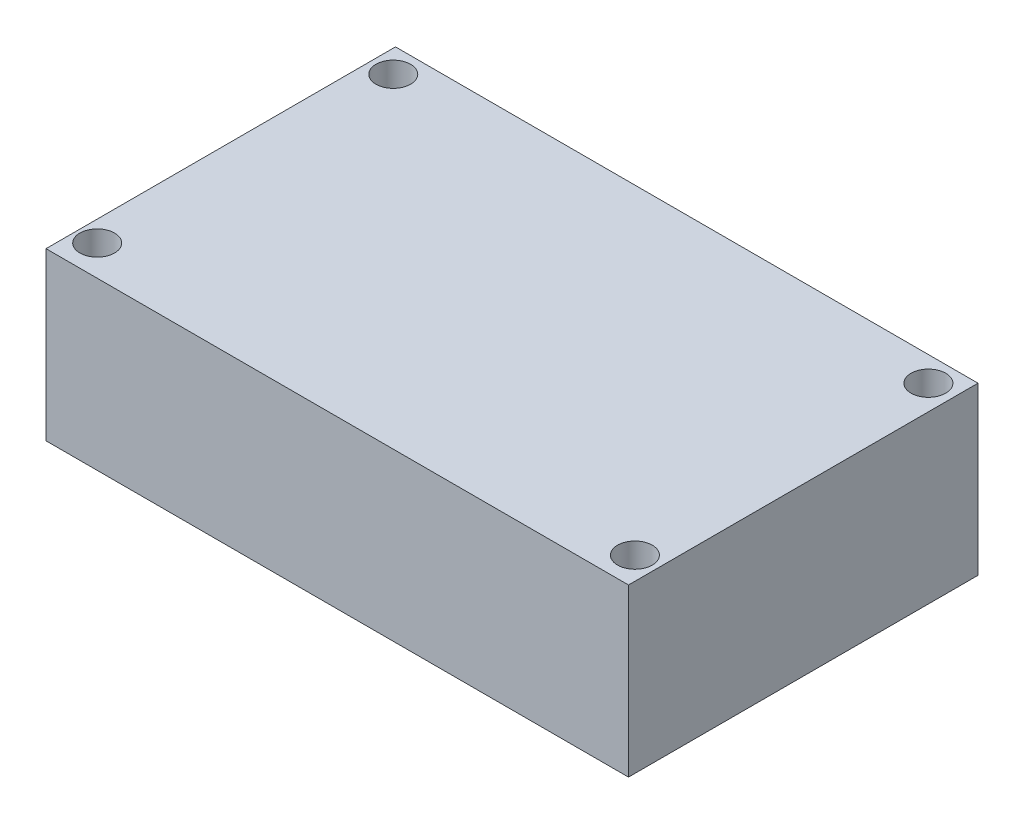
ISO-10303-21;
HEADER;
FILE_DESCRIPTION(('STEP AP214'),'2;1');
FILE_NAME('part.step','',(''),(''),'','','');
FILE_SCHEMA(('AUTOMOTIVE_DESIGN { 1 0 10303 214 1 1 1 1 }'));
ENDSEC;
DATA;
#1=APPLICATION_CONTEXT('core data for automotive mechanical design processes');
#2=APPLICATION_PROTOCOL_DEFINITION('international standard','automotive_design',2000,#1);
#3=PRODUCT_CONTEXT('',#1,'mechanical');
#4=PRODUCT('Part','Part','',(#3));
#5=PRODUCT_RELATED_PRODUCT_CATEGORY('part','',(#4));
#6=PRODUCT_DEFINITION_FORMATION('','',#4);
#7=PRODUCT_DEFINITION_CONTEXT('part definition',#1,'design');
#8=PRODUCT_DEFINITION('design','',#6,#7);
#9=PRODUCT_DEFINITION_SHAPE('','',#8);
#10=(LENGTH_UNIT() NAMED_UNIT(*) SI_UNIT(.MILLI.,.METRE.));
#11=(NAMED_UNIT(*) PLANE_ANGLE_UNIT() SI_UNIT($,.RADIAN.));
#12=(NAMED_UNIT(*) SI_UNIT($,.STERADIAN.) SOLID_ANGLE_UNIT());
#13=UNCERTAINTY_MEASURE_WITH_UNIT(LENGTH_MEASURE(1.E-05),#10,'distance_accuracy_value','');
#14=(GEOMETRIC_REPRESENTATION_CONTEXT(3) GLOBAL_UNCERTAINTY_ASSIGNED_CONTEXT((#13)) GLOBAL_UNIT_ASSIGNED_CONTEXT((#10,
#11,#12)) REPRESENTATION_CONTEXT('',''));
#15=CARTESIAN_POINT('',(0.,0.,0.));
#16=DIRECTION('',(0.,0.,1.));
#17=DIRECTION('',(1.,0.,0.));
#18=AXIS2_PLACEMENT_3D('',#15,#16,#17);
#19=CARTESIAN_POINT('',(21.,12.,12.6));
#20=DIRECTION('',(-1.,0.,0.));
#21=DIRECTION('',(0.,0.,1.));
#22=AXIS2_PLACEMENT_3D('',#19,#20,#21);
#23=PLANE('',#22);
#24=DIRECTION('',(0.,0.,-1.));
#25=VECTOR('',#24,1.);
#26=CARTESIAN_POINT('',(21.,0.,12.6));
#27=LINE('',#26,#25);
#28=CARTESIAN_POINT('',(21.,0.,12.6));
#29=VERTEX_POINT('',#28);
#30=CARTESIAN_POINT('',(21.,0.,-12.6));
#31=VERTEX_POINT('',#30);
#32=EDGE_CURVE('E115',#29,#31,#27,.T.);
#33=ORIENTED_EDGE('',*,*,#32,.T.);
#34=DIRECTION('',(0.,-1.,0.));
#35=VECTOR('',#34,1.);
#36=CARTESIAN_POINT('',(21.,12.,-12.6));
#37=LINE('',#36,#35);
#38=CARTESIAN_POINT('',(21.,12.,-12.6));
#39=VERTEX_POINT('',#38);
#40=EDGE_CURVE('E11',#39,#31,#37,.T.);
#41=ORIENTED_EDGE('',*,*,#40,.F.);
#42=DIRECTION('',(0.,0.,-1.));
#43=VECTOR('',#42,1.);
#44=CARTESIAN_POINT('',(21.,12.,12.6));
#45=LINE('',#44,#43);
#46=CARTESIAN_POINT('',(21.,12.,12.6));
#47=VERTEX_POINT('',#46);
#48=EDGE_CURVE('E98',#47,#39,#45,.T.);
#49=ORIENTED_EDGE('',*,*,#48,.F.);
#50=DIRECTION('',(0.,-1.,0.));
#51=VECTOR('',#50,1.);
#52=CARTESIAN_POINT('',(21.,12.,12.6));
#53=LINE('',#52,#51);
#54=EDGE_CURVE('E111',#47,#29,#53,.T.);
#55=ORIENTED_EDGE('',*,*,#54,.T.);
#56=EDGE_LOOP('',(#33,#41,#49,#55));
#57=FACE_BOUND('',#56,.T.);
#58=ADVANCED_FACE('F44',(#57),#23,.F.);
#59=CARTESIAN_POINT('',(-21.,12.,-12.6));
#60=DIRECTION('',(0.,0.,1.));
#61=DIRECTION('',(1.,0.,0.));
#62=AXIS2_PLACEMENT_3D('',#59,#60,#61);
#63=PLANE('',#62);
#64=DIRECTION('',(-1.,0.,0.));
#65=VECTOR('',#64,1.);
#66=CARTESIAN_POINT('',(-21.,0.,-12.6));
#67=LINE('',#66,#65);
#68=CARTESIAN_POINT('',(-21.,0.,-12.6));
#69=VERTEX_POINT('',#68);
#70=EDGE_CURVE('E103',#31,#69,#67,.T.);
#71=ORIENTED_EDGE('',*,*,#70,.T.);
#72=DIRECTION('',(0.,-1.,0.));
#73=VECTOR('',#72,1.);
#74=CARTESIAN_POINT('',(-21.,12.,-12.6));
#75=LINE('',#74,#73);
#76=CARTESIAN_POINT('',(-21.,12.,-12.6));
#77=VERTEX_POINT('',#76);
#78=EDGE_CURVE('E54',#77,#69,#75,.T.);
#79=ORIENTED_EDGE('',*,*,#78,.F.);
#80=DIRECTION('',(-1.,0.,0.));
#81=VECTOR('',#80,1.);
#82=CARTESIAN_POINT('',(-21.,12.,-12.6));
#83=LINE('',#82,#81);
#84=EDGE_CURVE('E93',#39,#77,#83,.T.);
#85=ORIENTED_EDGE('',*,*,#84,.F.);
#86=ORIENTED_EDGE('',*,*,#40,.T.);
#87=EDGE_LOOP('',(#71,#79,#85,#86));
#88=FACE_BOUND('',#87,.T.);
#89=ADVANCED_FACE('F102',(#88),#63,.F.);
#90=CARTESIAN_POINT('',(-21.,12.,12.6));
#91=DIRECTION('',(1.,0.,0.));
#92=DIRECTION('',(0.,0.,-1.));
#93=AXIS2_PLACEMENT_3D('',#90,#91,#92);
#94=PLANE('',#93);
#95=DIRECTION('',(0.,0.,1.));
#96=VECTOR('',#95,1.);
#97=CARTESIAN_POINT('',(-21.,0.,12.6));
#98=LINE('',#97,#96);
#99=CARTESIAN_POINT('',(-21.,0.,12.6));
#100=VERTEX_POINT('',#99);
#101=EDGE_CURVE('E80',#69,#100,#98,.T.);
#102=ORIENTED_EDGE('',*,*,#101,.T.);
#103=DIRECTION('',(0.,-1.,0.));
#104=VECTOR('',#103,1.);
#105=CARTESIAN_POINT('',(-21.,12.,12.6));
#106=LINE('',#105,#104);
#107=CARTESIAN_POINT('',(-21.,12.,12.6));
#108=VERTEX_POINT('',#107);
#109=EDGE_CURVE('E105',#108,#100,#106,.T.);
#110=ORIENTED_EDGE('',*,*,#109,.F.);
#111=DIRECTION('',(0.,0.,1.));
#112=VECTOR('',#111,1.);
#113=CARTESIAN_POINT('',(-21.,12.,12.6));
#114=LINE('',#113,#112);
#115=EDGE_CURVE('E96',#77,#108,#114,.T.);
#116=ORIENTED_EDGE('',*,*,#115,.F.);
#117=ORIENTED_EDGE('',*,*,#78,.T.);
#118=EDGE_LOOP('',(#102,#110,#116,#117));
#119=FACE_BOUND('',#118,.T.);
#120=ADVANCED_FACE('F107',(#119),#94,.F.);
#121=CARTESIAN_POINT('',(-21.,12.,12.6));
#122=DIRECTION('',(0.,0.,-1.));
#123=DIRECTION('',(-1.,0.,0.));
#124=AXIS2_PLACEMENT_3D('',#121,#122,#123);
#125=PLANE('',#124);
#126=DIRECTION('',(1.,0.,0.));
#127=VECTOR('',#126,1.);
#128=CARTESIAN_POINT('',(-21.,0.,12.6));
#129=LINE('',#128,#127);
#130=EDGE_CURVE('E86',#100,#29,#129,.T.);
#131=ORIENTED_EDGE('',*,*,#130,.T.);
#132=ORIENTED_EDGE('',*,*,#54,.F.);
#133=DIRECTION('',(1.,0.,0.));
#134=VECTOR('',#133,1.);
#135=CARTESIAN_POINT('',(-21.,12.,12.6));
#136=LINE('',#135,#134);
#137=EDGE_CURVE('E63',#108,#47,#136,.T.);
#138=ORIENTED_EDGE('',*,*,#137,.F.);
#139=ORIENTED_EDGE('',*,*,#109,.T.);
#140=EDGE_LOOP('',(#131,#132,#138,#139));
#141=FACE_BOUND('',#140,.T.);
#142=ADVANCED_FACE('F161',(#141),#125,.F.);
#143=CARTESIAN_POINT('',(0.,12.,0.));
#144=DIRECTION('',(0.,-1.,0.));
#145=DIRECTION('',(0.,0.,-1.));
#146=AXIS2_PLACEMENT_3D('',#143,#144,#145);
#147=PLANE('',#146);
#148=CARTESIAN_POINT('',(19.2137926164071,12.,-10.809635356141));
#149=DIRECTION('',(0.,1.,0.));
#150=DIRECTION('',(0.,0.,1.));
#151=AXIS2_PLACEMENT_3D('',#148,#149,#150);
#152=CIRCLE('',#151,1.25);
#153=CARTESIAN_POINT('',(19.2137926164071,12.,-9.55963535614099));
#154=VERTEX_POINT('',#153);
#155=EDGE_CURVE('E245',#154,#154,#152,.T.);
#156=ORIENTED_EDGE('',*,*,#155,.F.);
#157=EDGE_LOOP('',(#156));
#158=FACE_BOUND('',#157,.T.);
#159=CARTESIAN_POINT('',(19.3681911756386,12.,10.5070054423382));
#160=DIRECTION('',(0.,1.,0.));
#161=DIRECTION('',(0.,0.,1.));
#162=AXIS2_PLACEMENT_3D('',#159,#160,#161);
#163=CIRCLE('',#162,1.25);
#164=CARTESIAN_POINT('',(19.3681911756386,12.,11.7570054423382));
#165=VERTEX_POINT('',#164);
#166=EDGE_CURVE('E241',#165,#165,#163,.T.);
#167=ORIENTED_EDGE('',*,*,#166,.F.);
#168=EDGE_LOOP('',(#167));
#169=FACE_BOUND('',#168,.T.);
#170=CARTESIAN_POINT('',(-19.5048075821324,12.,10.4032111577952));
#171=DIRECTION('',(0.,1.,0.));
#172=DIRECTION('',(0.,0.,1.));
#173=AXIS2_PLACEMENT_3D('',#170,#171,#172);
#174=CIRCLE('',#173,1.25);
#175=CARTESIAN_POINT('',(-19.5048075821324,12.,11.6532111577952));
#176=VERTEX_POINT('',#175);
#177=EDGE_CURVE('E244',#176,#176,#174,.T.);
#178=ORIENTED_EDGE('',*,*,#177,.F.);
#179=EDGE_LOOP('',(#178));
#180=FACE_BOUND('',#179,.T.);
#181=CARTESIAN_POINT('',(-19.3711957999113,12.,-10.809635356141));
#182=DIRECTION('',(0.,1.,0.));
#183=DIRECTION('',(0.,0.,1.));
#184=AXIS2_PLACEMENT_3D('',#181,#182,#183);
#185=CIRCLE('',#184,1.25);
#186=CARTESIAN_POINT('',(-19.3711957999113,12.,-9.55963535614099));
#187=VERTEX_POINT('',#186);
#188=EDGE_CURVE('E134',#187,#187,#185,.T.);
#189=ORIENTED_EDGE('',*,*,#188,.F.);
#190=EDGE_LOOP('',(#189));
#191=FACE_BOUND('',#190,.T.);
#192=ORIENTED_EDGE('',*,*,#48,.T.);
#193=ORIENTED_EDGE('',*,*,#84,.T.);
#194=ORIENTED_EDGE('',*,*,#115,.T.);
#195=ORIENTED_EDGE('',*,*,#137,.T.);
#196=EDGE_LOOP('',(#192,#193,#194,#195));
#197=FACE_BOUND('',#196,.T.);
#198=ADVANCED_FACE('F94',(#158,#169,#180,#191,#197),#147,.F.);
#199=CARTESIAN_POINT('',(0.,0.,0.));
#200=DIRECTION('',(0.,-1.,0.));
#201=DIRECTION('',(0.,0.,-1.));
#202=AXIS2_PLACEMENT_3D('',#199,#200,#201);
#203=PLANE('',#202);
#204=CARTESIAN_POINT('',(19.2137926164071,0.,-10.809635356141));
#205=DIRECTION('',(0.,-1.,0.));
#206=DIRECTION('',(0.,0.,-1.));
#207=AXIS2_PLACEMENT_3D('',#204,#205,#206);
#208=CIRCLE('',#207,1.25);
#209=CARTESIAN_POINT('',(19.2137926164071,0.,-12.059635356141));
#210=VERTEX_POINT('',#209);
#211=EDGE_CURVE('E47',#210,#210,#208,.T.);
#212=ORIENTED_EDGE('',*,*,#211,.F.);
#213=EDGE_LOOP('',(#212));
#214=FACE_BOUND('',#213,.T.);
#215=CARTESIAN_POINT('',(19.3681911756386,0.,10.5070054423382));
#216=DIRECTION('',(0.,-1.,0.));
#217=DIRECTION('',(0.,0.,-1.));
#218=AXIS2_PLACEMENT_3D('',#215,#216,#217);
#219=CIRCLE('',#218,1.25);
#220=CARTESIAN_POINT('',(19.3681911756386,0.,9.25700544233823));
#221=VERTEX_POINT('',#220);
#222=EDGE_CURVE('E137',#221,#221,#219,.T.);
#223=ORIENTED_EDGE('',*,*,#222,.F.);
#224=EDGE_LOOP('',(#223));
#225=FACE_BOUND('',#224,.T.);
#226=CARTESIAN_POINT('',(-19.5048075821324,0.,10.4032111577952));
#227=DIRECTION('',(0.,-1.,0.));
#228=DIRECTION('',(0.,0.,-1.));
#229=AXIS2_PLACEMENT_3D('',#226,#227,#228);
#230=CIRCLE('',#229,1.25);
#231=CARTESIAN_POINT('',(-19.5048075821324,0.,9.15321115779519));
#232=VERTEX_POINT('',#231);
#233=EDGE_CURVE('E133',#232,#232,#230,.T.);
#234=ORIENTED_EDGE('',*,*,#233,.F.);
#235=EDGE_LOOP('',(#234));
#236=FACE_BOUND('',#235,.T.);
#237=CARTESIAN_POINT('',(-19.3711957999113,0.,-10.809635356141));
#238=DIRECTION('',(0.,-1.,0.));
#239=DIRECTION('',(0.,0.,-1.));
#240=AXIS2_PLACEMENT_3D('',#237,#238,#239);
#241=CIRCLE('',#240,1.25);
#242=CARTESIAN_POINT('',(-19.3711957999113,0.,-12.059635356141));
#243=VERTEX_POINT('',#242);
#244=EDGE_CURVE('E129',#243,#243,#241,.T.);
#245=ORIENTED_EDGE('',*,*,#244,.F.);
#246=EDGE_LOOP('',(#245));
#247=FACE_BOUND('',#246,.T.);
#248=ORIENTED_EDGE('',*,*,#32,.F.);
#249=ORIENTED_EDGE('',*,*,#130,.F.);
#250=ORIENTED_EDGE('',*,*,#101,.F.);
#251=ORIENTED_EDGE('',*,*,#70,.F.);
#252=EDGE_LOOP('',(#248,#249,#250,#251));
#253=FACE_BOUND('',#252,.T.);
#254=ADVANCED_FACE('F149',(#214,#225,#236,#247,#253),#203,.T.);
#255=CARTESIAN_POINT('',(-19.3711957999113,-8.,-10.809635356141));
#256=DIRECTION('',(0.,1.,0.));
#257=DIRECTION('',(0.,0.,1.));
#258=AXIS2_PLACEMENT_3D('',#255,#256,#257);
#259=CYLINDRICAL_SURFACE('',#258,1.25);
#260=ORIENTED_EDGE('',*,*,#244,.T.);
#261=EDGE_LOOP('',(#260));
#262=FACE_BOUND('',#261,.T.);
#263=ORIENTED_EDGE('',*,*,#188,.T.);
#264=EDGE_LOOP('',(#263));
#265=FACE_BOUND('',#264,.T.);
#266=ADVANCED_FACE('F152',(#262,#265),#259,.F.);
#267=CARTESIAN_POINT('',(-19.5048075821324,-8.,10.4032111577952));
#268=DIRECTION('',(0.,1.,0.));
#269=DIRECTION('',(0.,0.,1.));
#270=AXIS2_PLACEMENT_3D('',#267,#268,#269);
#271=CYLINDRICAL_SURFACE('',#270,1.25);
#272=ORIENTED_EDGE('',*,*,#233,.T.);
#273=EDGE_LOOP('',(#272));
#274=FACE_BOUND('',#273,.T.);
#275=ORIENTED_EDGE('',*,*,#177,.T.);
#276=EDGE_LOOP('',(#275));
#277=FACE_BOUND('',#276,.T.);
#278=ADVANCED_FACE('F208',(#274,#277),#271,.F.);
#279=CARTESIAN_POINT('',(19.3681911756386,-8.,10.5070054423382));
#280=DIRECTION('',(0.,1.,0.));
#281=DIRECTION('',(0.,0.,1.));
#282=AXIS2_PLACEMENT_3D('',#279,#280,#281);
#283=CYLINDRICAL_SURFACE('',#282,1.25);
#284=ORIENTED_EDGE('',*,*,#222,.T.);
#285=EDGE_LOOP('',(#284));
#286=FACE_BOUND('',#285,.T.);
#287=ORIENTED_EDGE('',*,*,#166,.T.);
#288=EDGE_LOOP('',(#287));
#289=FACE_BOUND('',#288,.T.);
#290=ADVANCED_FACE('F218',(#286,#289),#283,.F.);
#291=CARTESIAN_POINT('',(19.2137926164071,-8.,-10.809635356141));
#292=DIRECTION('',(0.,1.,0.));
#293=DIRECTION('',(0.,0.,1.));
#294=AXIS2_PLACEMENT_3D('',#291,#292,#293);
#295=CYLINDRICAL_SURFACE('',#294,1.25);
#296=ORIENTED_EDGE('',*,*,#211,.T.);
#297=EDGE_LOOP('',(#296));
#298=FACE_BOUND('',#297,.T.);
#299=ORIENTED_EDGE('',*,*,#155,.T.);
#300=EDGE_LOOP('',(#299));
#301=FACE_BOUND('',#300,.T.);
#302=ADVANCED_FACE('F146',(#298,#301),#295,.F.);
#303=CLOSED_SHELL('',(#58,#89,#120,#142,#198,#254,#266,#278,#290,#302));
#304=MANIFOLD_SOLID_BREP('B2',#303);
#305=ADVANCED_BREP_SHAPE_REPRESENTATION('',(#18,#304),#14);
#306=SHAPE_DEFINITION_REPRESENTATION(#9,#305);
ENDSEC;
END-ISO-10303-21;
